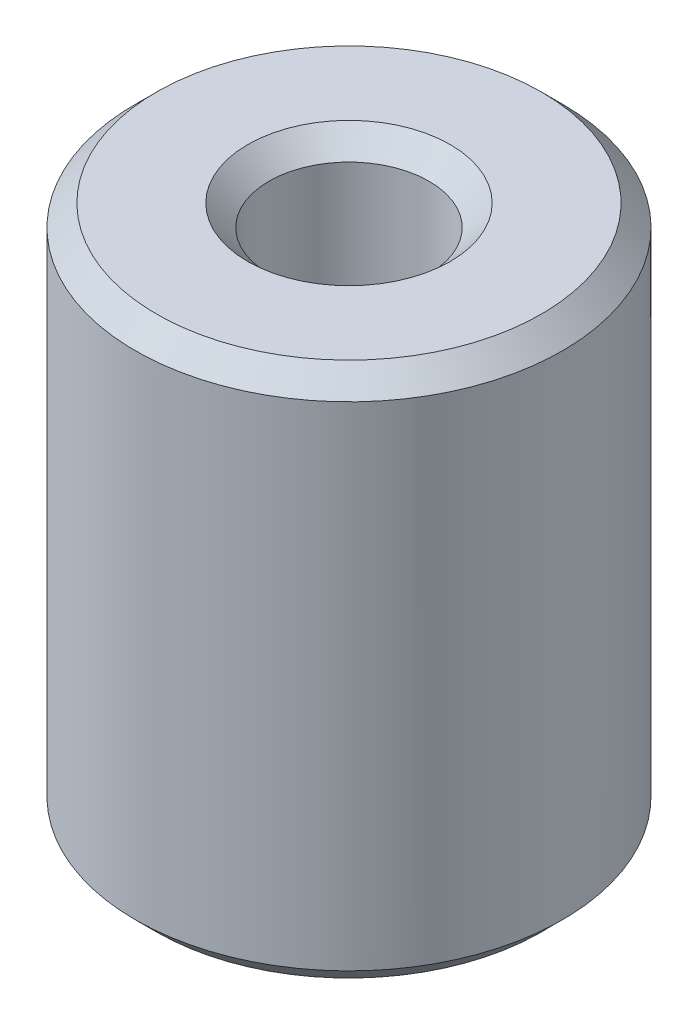
ISO-10303-21;
HEADER;
FILE_DESCRIPTION(('STEP AP214'),'2;1');
FILE_NAME('part.step','',(''),(''),'','','');
FILE_SCHEMA(('AUTOMOTIVE_DESIGN { 1 0 10303 214 1 1 1 1 }'));
ENDSEC;
DATA;
#1=APPLICATION_CONTEXT('core data for automotive mechanical design processes');
#2=APPLICATION_PROTOCOL_DEFINITION('international standard','automotive_design',2000,#1);
#3=PRODUCT_CONTEXT('',#1,'mechanical');
#4=PRODUCT('Part','Part','',(#3));
#5=PRODUCT_RELATED_PRODUCT_CATEGORY('part','',(#4));
#6=PRODUCT_DEFINITION_FORMATION('','',#4);
#7=PRODUCT_DEFINITION_CONTEXT('part definition',#1,'design');
#8=PRODUCT_DEFINITION('design','',#6,#7);
#9=PRODUCT_DEFINITION_SHAPE('','',#8);
#10=(LENGTH_UNIT() NAMED_UNIT(*) SI_UNIT(.MILLI.,.METRE.));
#11=(NAMED_UNIT(*) PLANE_ANGLE_UNIT() SI_UNIT($,.RADIAN.));
#12=(NAMED_UNIT(*) SI_UNIT($,.STERADIAN.) SOLID_ANGLE_UNIT());
#13=UNCERTAINTY_MEASURE_WITH_UNIT(LENGTH_MEASURE(1.E-05),#10,'distance_accuracy_value','');
#14=(GEOMETRIC_REPRESENTATION_CONTEXT(3) GLOBAL_UNCERTAINTY_ASSIGNED_CONTEXT((#13)) GLOBAL_UNIT_ASSIGNED_CONTEXT((#10,
#11,#12)) REPRESENTATION_CONTEXT('',''));
#15=CARTESIAN_POINT('',(0.,0.,0.));
#16=DIRECTION('',(0.,0.,1.));
#17=DIRECTION('',(1.,0.,0.));
#18=AXIS2_PLACEMENT_3D('',#15,#16,#17);
#19=CARTESIAN_POINT('',(0.,43.848574181793,0.));
#20=DIRECTION('',(0.,-1.,0.));
#21=DIRECTION('',(0.,0.,-1.));
#22=AXIS2_PLACEMENT_3D('',#19,#20,#21);
#23=CYLINDRICAL_SURFACE('',#22,17.5);
#24=CARTESIAN_POINT('',(0.,1.73431789356408,0.));
#25=DIRECTION('',(0.,1.,0.));
#26=DIRECTION('',(0.,0.,1.));
#27=AXIS2_PLACEMENT_3D('',#24,#25,#26);
#28=CIRCLE('',#27,17.5);
#29=CARTESIAN_POINT('',(0.,1.73431789356408,17.5));
#30=VERTEX_POINT('',#29);
#31=EDGE_CURVE('E10',#30,#30,#28,.T.);
#32=ORIENTED_EDGE('',*,*,#31,.T.);
#33=EDGE_LOOP('',(#32));
#34=FACE_BOUND('',#33,.T.);
#35=CARTESIAN_POINT('',(0.,42.1142562882289,0.));
#36=DIRECTION('',(0.,1.,0.));
#37=DIRECTION('',(0.,0.,1.));
#38=AXIS2_PLACEMENT_3D('',#35,#36,#37);
#39=CIRCLE('',#38,17.5);
#40=CARTESIAN_POINT('',(0.,42.1142562882289,-17.5));
#41=VERTEX_POINT('',#40);
#42=EDGE_CURVE('E50',#41,#41,#39,.F.);
#43=ORIENTED_EDGE('',*,*,#42,.T.);
#44=EDGE_LOOP('',(#43));
#45=FACE_BOUND('',#44,.T.);
#46=ADVANCED_FACE('F39',(#34,#45),#23,.T.);
#47=CARTESIAN_POINT('',(0.,43.848574181793,0.));
#48=DIRECTION('',(0.,1.,0.));
#49=DIRECTION('',(0.,0.,1.));
#50=AXIS2_PLACEMENT_3D('',#47,#48,#49);
#51=PLANE('',#50);
#52=CARTESIAN_POINT('',(0.,43.848574181793,0.));
#53=DIRECTION('',(0.,1.,0.));
#54=DIRECTION('',(0.,0.,1.));
#55=AXIS2_PLACEMENT_3D('',#52,#53,#54);
#56=CIRCLE('',#55,8.29833099222584);
#57=CARTESIAN_POINT('',(0.,43.848574181793,8.29833099222584));
#58=VERTEX_POINT('',#57);
#59=EDGE_CURVE('E58',#58,#58,#56,.F.);
#60=ORIENTED_EDGE('',*,*,#59,.T.);
#61=EDGE_LOOP('',(#60));
#62=FACE_BOUND('',#61,.T.);
#63=CARTESIAN_POINT('',(0.,43.848574181793,0.));
#64=DIRECTION('',(0.,1.,0.));
#65=DIRECTION('',(0.,0.,1.));
#66=AXIS2_PLACEMENT_3D('',#63,#64,#65);
#67=CIRCLE('',#66,15.7656821064359);
#68=CARTESIAN_POINT('',(0.,43.848574181793,-15.7656821064359));
#69=VERTEX_POINT('',#68);
#70=EDGE_CURVE('E61',#69,#69,#67,.T.);
#71=ORIENTED_EDGE('',*,*,#70,.T.);
#72=EDGE_LOOP('',(#71));
#73=FACE_BOUND('',#72,.T.);
#74=ADVANCED_FACE('F88',(#62,#73),#51,.T.);
#75=CARTESIAN_POINT('',(0.,0.,0.));
#76=DIRECTION('',(0.,1.,0.));
#77=DIRECTION('',(0.,0.,1.));
#78=AXIS2_PLACEMENT_3D('',#75,#76,#77);
#79=PLANE('',#78);
#80=CARTESIAN_POINT('',(0.,0.,0.));
#81=DIRECTION('',(0.,1.,0.));
#82=DIRECTION('',(0.,0.,1.));
#83=AXIS2_PLACEMENT_3D('',#80,#81,#82);
#84=CIRCLE('',#83,8.29833099222584);
#85=CARTESIAN_POINT('',(0.,0.,-8.29833099222584));
#86=VERTEX_POINT('',#85);
#87=EDGE_CURVE('E51',#86,#86,#84,.T.);
#88=ORIENTED_EDGE('',*,*,#87,.T.);
#89=EDGE_LOOP('',(#88));
#90=FACE_BOUND('',#89,.T.);
#91=CARTESIAN_POINT('',(0.,0.,0.));
#92=DIRECTION('',(0.,1.,0.));
#93=DIRECTION('',(0.,0.,1.));
#94=AXIS2_PLACEMENT_3D('',#91,#92,#93);
#95=CIRCLE('',#94,15.7656821064359);
#96=CARTESIAN_POINT('',(0.,0.,15.7656821064359));
#97=VERTEX_POINT('',#96);
#98=EDGE_CURVE('E54',#97,#97,#95,.F.);
#99=ORIENTED_EDGE('',*,*,#98,.T.);
#100=EDGE_LOOP('',(#99));
#101=FACE_BOUND('',#100,.T.);
#102=ADVANCED_FACE('F83',(#90,#101),#79,.F.);
#103=CARTESIAN_POINT('',(0.,43.848574181793,0.));
#104=DIRECTION('',(0.,-1.,0.));
#105=DIRECTION('',(0.,0.,-1.));
#106=AXIS2_PLACEMENT_3D('',#103,#104,#105);
#107=CYLINDRICAL_SURFACE('',#106,6.56401309866176);
#108=CARTESIAN_POINT('',(0.,42.1142562882289,0.));
#109=DIRECTION('',(0.,1.,0.));
#110=DIRECTION('',(0.,0.,1.));
#111=AXIS2_PLACEMENT_3D('',#108,#109,#110);
#112=CIRCLE('',#111,6.56401309866176);
#113=CARTESIAN_POINT('',(0.,42.1142562882289,6.56401309866176));
#114=VERTEX_POINT('',#113);
#115=EDGE_CURVE('E67',#114,#114,#112,.T.);
#116=ORIENTED_EDGE('',*,*,#115,.T.);
#117=EDGE_LOOP('',(#116));
#118=FACE_BOUND('',#117,.T.);
#119=CARTESIAN_POINT('',(0.,1.73431789356409,0.));
#120=DIRECTION('',(0.,1.,0.));
#121=DIRECTION('',(0.,0.,1.));
#122=AXIS2_PLACEMENT_3D('',#119,#120,#121);
#123=CIRCLE('',#122,6.56401309866176);
#124=CARTESIAN_POINT('',(0.,1.73431789356409,-6.56401309866176));
#125=VERTEX_POINT('',#124);
#126=EDGE_CURVE('E69',#125,#125,#123,.F.);
#127=ORIENTED_EDGE('',*,*,#126,.T.);
#128=EDGE_LOOP('',(#127));
#129=FACE_BOUND('',#128,.T.);
#130=ADVANCED_FACE('F71',(#118,#129),#107,.F.);
#131=CARTESIAN_POINT('',(0.,42.1142562882289,0.));
#132=DIRECTION('',(0.,1.,0.));
#133=DIRECTION('',(0.,0.,1.));
#134=AXIS2_PLACEMENT_3D('',#131,#132,#133);
#135=CONICAL_SURFACE('',#134,6.56401309866176,0.785398163397453);
#136=ORIENTED_EDGE('',*,*,#59,.F.);
#137=EDGE_LOOP('',(#136));
#138=FACE_BOUND('',#137,.T.);
#139=ORIENTED_EDGE('',*,*,#115,.F.);
#140=EDGE_LOOP('',(#139));
#141=FACE_BOUND('',#140,.T.);
#142=ADVANCED_FACE('F77',(#138,#141),#135,.F.);
#143=CARTESIAN_POINT('',(0.,0.,0.));
#144=DIRECTION('',(0.,-1.,0.));
#145=DIRECTION('',(0.,0.,-1.));
#146=AXIS2_PLACEMENT_3D('',#143,#144,#145);
#147=CONICAL_SURFACE('',#146,8.29833099222584,0.785398163397445);
#148=CARTESIAN_POINT('',(0.,1.73431789356409,-6.56401309866176));
#149=CARTESIAN_POINT('',(0.,1.7162520821728,-6.58207891005305));
#150=CARTESIAN_POINT('',(0.,1.6981862707815,-6.60014472144434));
#151=CARTESIAN_POINT('',(0.,1.66205464799892,-6.63627634422693));
#152=CARTESIAN_POINT('',(0.,1.64398883660763,-6.65434215561822));
#153=CARTESIAN_POINT('',(0.,1.60785721382504,-6.6904737784008));
#154=CARTESIAN_POINT('',(0.,1.58979140243375,-6.7085395897921));
#155=CARTESIAN_POINT('',(0.,1.55365977965116,-6.74467121257468));
#156=CARTESIAN_POINT('',(0.,1.53559396825987,-6.76273702396597));
#157=CARTESIAN_POINT('',(0.,1.49946234547729,-6.79886864674856));
#158=CARTESIAN_POINT('',(0.,1.48139653408599,-6.81693445813985));
#159=CARTESIAN_POINT('',(0.,1.44526491130341,-6.85306608092244));
#160=CARTESIAN_POINT('',(0.,1.42719909991212,-6.87113189231373));
#161=CARTESIAN_POINT('',(0.,1.39106747712953,-6.90726351509631));
#162=CARTESIAN_POINT('',(0.,1.37300166573824,-6.92532932648761));
#163=CARTESIAN_POINT('',(0.,1.33687004295565,-6.96146094927019));
#164=CARTESIAN_POINT('',(0.,1.31880423156436,-6.97952676066148));
#165=CARTESIAN_POINT('',(0.,1.28267260878177,-7.01565838344407));
#166=CARTESIAN_POINT('',(0.,1.26460679739048,-7.03372419483536));
#167=CARTESIAN_POINT('',(0.,1.2284751746079,-7.06985581761795));
#168=CARTESIAN_POINT('',(0.,1.2104093632166,-7.08792162900924));
#169=CARTESIAN_POINT('',(0.,1.17427774043402,-7.12405325179182));
#170=CARTESIAN_POINT('',(0.,1.15621192904273,-7.14211906318312));
#171=CARTESIAN_POINT('',(0.,1.12008030626014,-7.1782506859657));
#172=CARTESIAN_POINT('',(0.,1.10201449486885,-7.19631649735699));
#173=CARTESIAN_POINT('',(0.,1.06588287208626,-7.23244812013958));
#174=CARTESIAN_POINT('',(0.,1.04781706069497,-7.25051393153087));
#175=CARTESIAN_POINT('',(0.,1.01168543791239,-7.28664555431346));
#176=CARTESIAN_POINT('',(0.,0.993619626521093,-7.30471136570475));
#177=CARTESIAN_POINT('',(0.,0.957488003738508,-7.34084298848733));
#178=CARTESIAN_POINT('',(0.,0.939422192347215,-7.35890879987863));
#179=CARTESIAN_POINT('',(0.,0.90329056956463,-7.39504042266121));
#180=CARTESIAN_POINT('',(0.,0.885224758173337,-7.4131062340525));
#181=CARTESIAN_POINT('',(0.,0.849093135390752,-7.44923785683509));
#182=CARTESIAN_POINT('',(0.,0.83102732399946,-7.46730366822638));
#183=CARTESIAN_POINT('',(0.,0.794895701216874,-7.50343529100897));
#184=CARTESIAN_POINT('',(0.,0.776829889825582,-7.52150110240026));
#185=CARTESIAN_POINT('',(0.,0.740698267042997,-7.55763272518284));
#186=CARTESIAN_POINT('',(0.,0.722632455651704,-7.57569853657414));
#187=CARTESIAN_POINT('',(0.,0.686500832869119,-7.61183015935672));
#188=CARTESIAN_POINT('',(0.,0.668435021477826,-7.62989597074801));
#189=CARTESIAN_POINT('',(0.,0.632303398695241,-7.6660275935306));
#190=CARTESIAN_POINT('',(0.,0.614237587303948,-7.68409340492189));
#191=CARTESIAN_POINT('',(0.,0.578105964521363,-7.72022502770448));
#192=CARTESIAN_POINT('',(0.,0.56004015313007,-7.73829083909577));
#193=CARTESIAN_POINT('',(0.,0.523908530347485,-7.77442246187835));
#194=CARTESIAN_POINT('',(0.,0.505842718956193,-7.79248827326965));
#195=CARTESIAN_POINT('',(0.,0.469711096173608,-7.82861989605223));
#196=CARTESIAN_POINT('',(0.,0.451645284782315,-7.84668570744352));
#197=CARTESIAN_POINT('',(0.,0.41551366199973,-7.88281733022611));
#198=CARTESIAN_POINT('',(0.,0.397447850608437,-7.9008831416174));
#199=CARTESIAN_POINT('',(0.,0.361316227825852,-7.93701476439999));
#200=CARTESIAN_POINT('',(0.,0.343250416434559,-7.95508057579128));
#201=CARTESIAN_POINT('',(0.,0.307118793651974,-7.99121219857386));
#202=CARTESIAN_POINT('',(0.,0.289052982260682,-8.00927800996516));
#203=CARTESIAN_POINT('',(0.,0.252921359478097,-8.04540963274774));
#204=CARTESIAN_POINT('',(0.,0.234855548086804,-8.06347544413903));
#205=CARTESIAN_POINT('',(0.,0.198723925304218,-8.09960706692162));
#206=CARTESIAN_POINT('',(0.,0.180658113912926,-8.11767287831291));
#207=CARTESIAN_POINT('',(0.,0.144526491130341,-8.15380450109549));
#208=CARTESIAN_POINT('',(0.,0.126460679739048,-8.17187031248679));
#209=CARTESIAN_POINT('',(0.,0.0903290569564631,-8.20800193526937));
#210=CARTESIAN_POINT('',(0.,0.0722632455651704,-8.22606774666067));
#211=CARTESIAN_POINT('',(0.,0.0361316227825849,-8.26219936944325));
#212=CARTESIAN_POINT('',(0.,0.0180658113912922,-8.28026518083454));
#213=CARTESIAN_POINT('',(0.,0.,-8.29833099222584));
#214=B_SPLINE_CURVE_WITH_KNOTS('',3,(#148,#149,#150,#151,#152,#153,#154,#155,#156,#157,#158,
#159,#160,#161,#162,#163,#164,#165,#166,#167,#168,#169,#170,#171,#172,#173,#174,#175,#176,#177,
#178,#179,#180,#181,#182,#183,#184,#185,#186,#187,#188,#189,#190,#191,#192,#193,#194,#195,#196,
#197,#198,#199,#200,#201,#202,#203,#204,#205,#206,#207,#208,#209,#210,#211,#212,#213),
.UNSPECIFIED.,.F.,.F.,(4,2,2,2,2,2,2,2,2,2,2,2,2,2,2,2,2,2,2,2,2,2,2,2,2,2,2,2,2,2,2,2,4),(0.,
0.0766467464545206,0.153293492909042,0.229940239363562,0.306586985818084,0.383233732272604,
0.459880478727125,0.536527225181646,0.613173971636167,0.689820718090687,0.766467464545208,
0.843114210999729,0.919760957454249,0.996407703908771,1.07305445036329,1.14970119681781,
1.22634794327233,1.30299468972685,1.37964143618137,1.4562881826359,1.53293492909042,
1.60958167554494,1.68622842199946,1.76287516845398,1.8395219149085,1.91616866136302,
1.99281540781754,2.06946215427206,2.14610890072658,2.2227556471811,2.29940239363562,
2.37604914009014,2.45269588654467),.UNSPECIFIED.);
#215=EDGE_CURVE('BSEAM73',#125,#86,#214,.T.);
#216=ORIENTED_EDGE('',*,*,#126,.F.);
#217=ORIENTED_EDGE('',*,*,#87,.F.);
#218=ORIENTED_EDGE('',*,*,#215,.T.);
#219=ORIENTED_EDGE('',*,*,#215,.F.);
#220=EDGE_LOOP('',(#216,#218,#217,#219));
#221=FACE_BOUND('',#220,.T.);
#222=ADVANCED_FACE('F73',(#221),#147,.F.);
#223=CARTESIAN_POINT('',(0.,1.73431789356408,0.));
#224=DIRECTION('',(0.,1.,0.));
#225=DIRECTION('',(0.,0.,1.));
#226=AXIS2_PLACEMENT_3D('',#223,#224,#225);
#227=CONICAL_SURFACE('',#226,17.5,0.785398163397453);
#228=ORIENTED_EDGE('',*,*,#98,.F.);
#229=EDGE_LOOP('',(#228));
#230=FACE_BOUND('',#229,.T.);
#231=ORIENTED_EDGE('',*,*,#31,.F.);
#232=EDGE_LOOP('',(#231));
#233=FACE_BOUND('',#232,.T.);
#234=ADVANCED_FACE('F76',(#230,#233),#227,.T.);
#235=CARTESIAN_POINT('',(0.,43.848574181793,0.));
#236=DIRECTION('',(0.,-1.,0.));
#237=DIRECTION('',(0.,0.,-1.));
#238=AXIS2_PLACEMENT_3D('',#235,#236,#237);
#239=CONICAL_SURFACE('',#238,15.7656821064359,0.785398163397441);
#240=CARTESIAN_POINT('',(0.,42.1142562882289,-17.5));
#241=CARTESIAN_POINT('',(0.,42.1323220996202,-17.4819341886087));
#242=CARTESIAN_POINT('',(0.,42.1503879110115,-17.4638683772174));
#243=CARTESIAN_POINT('',(0.,42.186519533794,-17.4277367544348));
#244=CARTESIAN_POINT('',(0.,42.2045853451853,-17.4096709430435));
#245=CARTESIAN_POINT('',(0.,42.2407169679679,-17.373539320261));
#246=CARTESIAN_POINT('',(0.,42.2587827793592,-17.3554735088697));
#247=CARTESIAN_POINT('',(0.,42.2949144021418,-17.3193418860871));
#248=CARTESIAN_POINT('',(0.,42.3129802135331,-17.3012760746958));
#249=CARTESIAN_POINT('',(0.,42.3491118363157,-17.2651444519132));
#250=CARTESIAN_POINT('',(0.,42.367177647707,-17.2470786405219));
#251=CARTESIAN_POINT('',(0.,42.4033092704896,-17.2109470177393));
#252=CARTESIAN_POINT('',(0.,42.4213750818808,-17.192881206348));
#253=CARTESIAN_POINT('',(0.,42.4575067046634,-17.1567495835655));
#254=CARTESIAN_POINT('',(0.,42.4755725160547,-17.1386837721742));
#255=CARTESIAN_POINT('',(0.,42.5117041388373,-17.1025521493916));
#256=CARTESIAN_POINT('',(0.,42.5297699502286,-17.0844863380003));
#257=CARTESIAN_POINT('',(0.,42.5659015730112,-17.0483547152177));
#258=CARTESIAN_POINT('',(0.,42.5839673844025,-17.0302889038264));
#259=CARTESIAN_POINT('',(0.,42.6200990071851,-16.9941572810438));
#260=CARTESIAN_POINT('',(0.,42.6381648185764,-16.9760914696525));
#261=CARTESIAN_POINT('',(0.,42.6742964413589,-16.9399598468699));
#262=CARTESIAN_POINT('',(0.,42.6923622527502,-16.9218940354787));
#263=CARTESIAN_POINT('',(0.,42.7284938755328,-16.8857624126961));
#264=CARTESIAN_POINT('',(0.,42.7465596869241,-16.8676966013048));
#265=CARTESIAN_POINT('',(0.,42.7826913097067,-16.8315649785222));
#266=CARTESIAN_POINT('',(0.,42.800757121098,-16.8134991671309));
#267=CARTESIAN_POINT('',(0.,42.8368887438806,-16.7773675443483));
#268=CARTESIAN_POINT('',(0.,42.8549545552719,-16.759301732957));
#269=CARTESIAN_POINT('',(0.,42.8910861780545,-16.7231701101744));
#270=CARTESIAN_POINT('',(0.,42.9091519894457,-16.7051042987831));
#271=CARTESIAN_POINT('',(0.,42.9452836122283,-16.6689726760006));
#272=CARTESIAN_POINT('',(0.,42.9633494236196,-16.6509068646093));
#273=CARTESIAN_POINT('',(0.,42.9994810464022,-16.6147752418267));
#274=CARTESIAN_POINT('',(0.,43.0175468577935,-16.5967094304354));
#275=CARTESIAN_POINT('',(0.,43.0536784805761,-16.5605778076528));
#276=CARTESIAN_POINT('',(0.,43.0717442919674,-16.5425119962615));
#277=CARTESIAN_POINT('',(0.,43.10787591475,-16.5063803734789));
#278=CARTESIAN_POINT('',(0.,43.1259417261413,-16.4883145620876));
#279=CARTESIAN_POINT('',(0.,43.1620733489238,-16.4521829393051));
#280=CARTESIAN_POINT('',(0.,43.1801391603151,-16.4341171279138));
#281=CARTESIAN_POINT('',(0.,43.2162707830977,-16.3979855051312));
#282=CARTESIAN_POINT('',(0.,43.234336594489,-16.3799196937399));
#283=CARTESIAN_POINT('',(0.,43.2704682172716,-16.3437880709573));
#284=CARTESIAN_POINT('',(0.,43.2885340286629,-16.325722259566));
#285=CARTESIAN_POINT('',(0.,43.3246656514455,-16.2895906367834));
#286=CARTESIAN_POINT('',(0.,43.3427314628368,-16.2715248253921));
#287=CARTESIAN_POINT('',(0.,43.3788630856194,-16.2353932026095));
#288=CARTESIAN_POINT('',(0.,43.3969288970106,-16.2173273912183));
#289=CARTESIAN_POINT('',(0.,43.4330605197932,-16.1811957684357));
#290=CARTESIAN_POINT('',(0.,43.4511263311845,-16.1631299570444));
#291=CARTESIAN_POINT('',(0.,43.4872579539671,-16.1269983342618));
#292=CARTESIAN_POINT('',(0.,43.5053237653584,-16.1089325228705));
#293=CARTESIAN_POINT('',(0.,43.541455388141,-16.0728009000879));
#294=CARTESIAN_POINT('',(0.,43.5595211995323,-16.0547350886966));
#295=CARTESIAN_POINT('',(0.,43.5956528223149,-16.018603465914));
#296=CARTESIAN_POINT('',(0.,43.6137186337062,-16.0005376545227));
#297=CARTESIAN_POINT('',(0.,43.6498502564887,-15.9644060317402));
#298=CARTESIAN_POINT('',(0.,43.66791606788,-15.9463402203489));
#299=CARTESIAN_POINT('',(0.,43.7040476906626,-15.9102085975663));
#300=CARTESIAN_POINT('',(0.,43.7221135020539,-15.892142786175));
#301=CARTESIAN_POINT('',(0.,43.7582451248365,-15.8560111633924));
#302=CARTESIAN_POINT('',(0.,43.7763109362278,-15.8379453520011));
#303=CARTESIAN_POINT('',(0.,43.8124425590104,-15.8018137292185));
#304=CARTESIAN_POINT('',(0.,43.8305083704017,-15.7837479178272));
#305=CARTESIAN_POINT('',(0.,43.848574181793,-15.7656821064359));
#306=B_SPLINE_CURVE_WITH_KNOTS('',3,(#240,#241,#242,#243,#244,#245,#246,#247,#248,#249,#250,
#251,#252,#253,#254,#255,#256,#257,#258,#259,#260,#261,#262,#263,#264,#265,#266,#267,#268,#269,
#270,#271,#272,#273,#274,#275,#276,#277,#278,#279,#280,#281,#282,#283,#284,#285,#286,#287,#288,
#289,#290,#291,#292,#293,#294,#295,#296,#297,#298,#299,#300,#301,#302,#303,#304,#305),
.UNSPECIFIED.,.F.,.F.,(4,2,2,2,2,2,2,2,2,2,2,2,2,2,2,2,2,2,2,2,2,2,2,2,2,2,2,2,2,2,2,2,4),(0.,
0.0766467464545238,0.153293492909043,0.229940239363562,0.306586985818083,0.383233732272607,
0.459880478727126,0.536527225181645,0.613173971636166,0.689820718090685,0.766467464545209,
0.843114210999728,0.919760957454249,0.996407703908768,1.07305445036329,1.14970119681781,
1.22634794327233,1.30299468972685,1.37964143618137,1.45628818263589,1.53293492909041,
1.60958167554493,1.68622842199945,1.76287516845398,1.8395219149085,1.91616866136301,
1.99281540781754,2.06946215427205,2.14610890072658,2.2227556471811,2.29940239363562,
2.37604914009014,2.45269588654466),.UNSPECIFIED.);
#307=EDGE_CURVE('BSEAM45',#41,#69,#306,.T.);
#308=ORIENTED_EDGE('',*,*,#42,.F.);
#309=ORIENTED_EDGE('',*,*,#70,.F.);
#310=ORIENTED_EDGE('',*,*,#307,.T.);
#311=ORIENTED_EDGE('',*,*,#307,.F.);
#312=EDGE_LOOP('',(#308,#310,#309,#311));
#313=FACE_BOUND('',#312,.T.);
#314=ADVANCED_FACE('F45',(#313),#239,.T.);
#315=CLOSED_SHELL('',(#46,#74,#102,#130,#142,#222,#234,#314));
#316=MANIFOLD_SOLID_BREP('B2',#315);
#317=ADVANCED_BREP_SHAPE_REPRESENTATION('',(#18,#316),#14);
#318=SHAPE_DEFINITION_REPRESENTATION(#9,#317);
ENDSEC;
END-ISO-10303-21;
